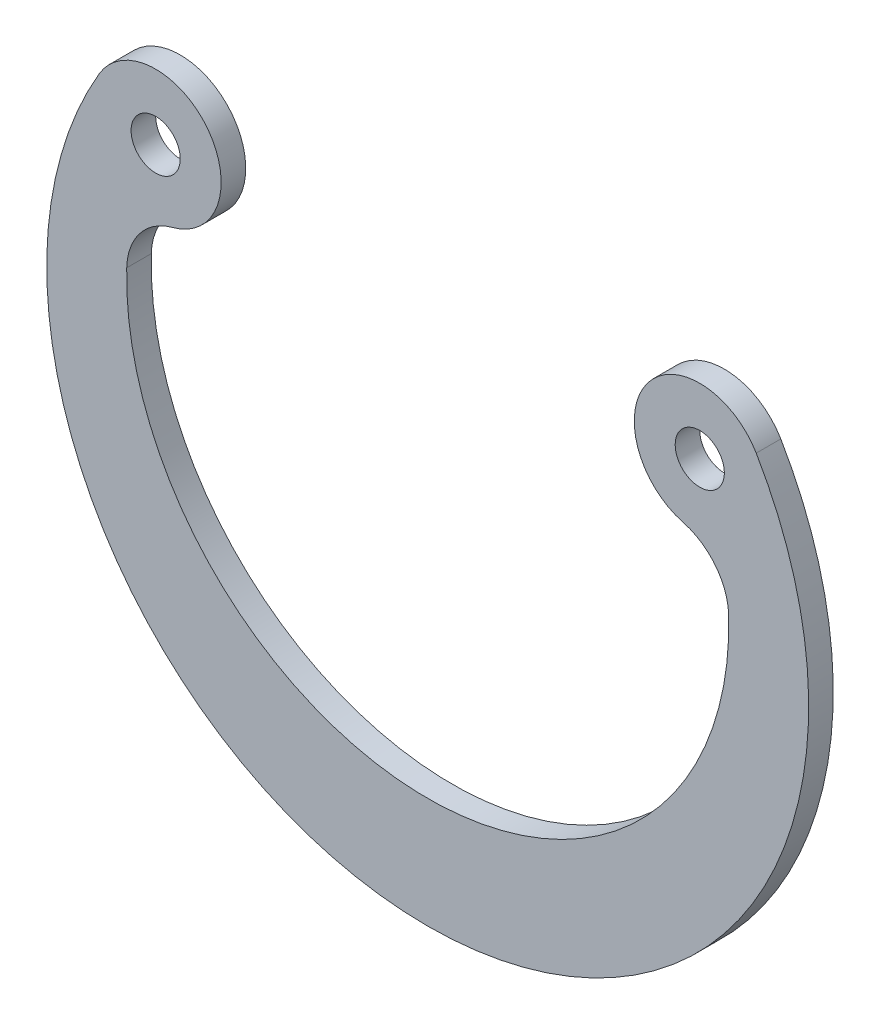
ISO-10303-21;
HEADER;
FILE_DESCRIPTION(('STEP AP214'),'2;1');
FILE_NAME('part.step','',(''),(''),'','','');
FILE_SCHEMA(('AUTOMOTIVE_DESIGN { 1 0 10303 214 1 1 1 1 }'));
ENDSEC;
DATA;
#1=APPLICATION_CONTEXT('core data for automotive mechanical design processes');
#2=APPLICATION_PROTOCOL_DEFINITION('international standard','automotive_design',2000,#1);
#3=PRODUCT_CONTEXT('',#1,'mechanical');
#4=PRODUCT('Part','Part','',(#3));
#5=PRODUCT_RELATED_PRODUCT_CATEGORY('part','',(#4));
#6=PRODUCT_DEFINITION_FORMATION('','',#4);
#7=PRODUCT_DEFINITION_CONTEXT('part definition',#1,'design');
#8=PRODUCT_DEFINITION('design','',#6,#7);
#9=PRODUCT_DEFINITION_SHAPE('','',#8);
#10=(LENGTH_UNIT() NAMED_UNIT(*) SI_UNIT(.MILLI.,.METRE.));
#11=(NAMED_UNIT(*) PLANE_ANGLE_UNIT() SI_UNIT($,.RADIAN.));
#12=(NAMED_UNIT(*) SI_UNIT($,.STERADIAN.) SOLID_ANGLE_UNIT());
#13=UNCERTAINTY_MEASURE_WITH_UNIT(LENGTH_MEASURE(1.E-05),#10,'distance_accuracy_value','');
#14=(GEOMETRIC_REPRESENTATION_CONTEXT(3) GLOBAL_UNCERTAINTY_ASSIGNED_CONTEXT((#13)) GLOBAL_UNIT_ASSIGNED_CONTEXT((#10,
#11,#12)) REPRESENTATION_CONTEXT('',''));
#15=CARTESIAN_POINT('',(0.,0.,0.));
#16=DIRECTION('',(0.,0.,1.));
#17=DIRECTION('',(1.,0.,0.));
#18=AXIS2_PLACEMENT_3D('',#15,#16,#17);
#19=CARTESIAN_POINT('',(-11.0679718105893,6.5,-1.));
#20=DIRECTION('',(0.,0.,1.));
#21=DIRECTION('',(1.,0.,0.));
#22=AXIS2_PLACEMENT_3D('',#19,#20,#21);
#23=CYLINDRICAL_SURFACE('',#22,2.66450234700656);
#24=CARTESIAN_POINT('',(-11.0679718105893,6.5,0.));
#25=DIRECTION('',(0.,0.,1.));
#26=DIRECTION('',(1.,0.,0.));
#27=AXIS2_PLACEMENT_3D('',#24,#25,#26);
#28=CIRCLE('',#27,2.66450234700656);
#29=CARTESIAN_POINT('',(-10.3862423091899,3.92418602299678,0.));
#30=VERTEX_POINT('',#29);
#31=CARTESIAN_POINT('',(-13.3655560307882,7.84932557535107,0.));
#32=VERTEX_POINT('',#31);
#33=EDGE_CURVE('E122',#30,#32,#28,.T.);
#34=ORIENTED_EDGE('',*,*,#33,.F.);
#35=DIRECTION('',(0.,0.,1.));
#36=VECTOR('',#35,1.);
#37=CARTESIAN_POINT('',(-10.3862423091899,3.92418602299678,-1.));
#38=LINE('',#37,#36);
#39=CARTESIAN_POINT('',(-10.3862423091899,3.92418602299678,-1.));
#40=VERTEX_POINT('',#39);
#41=EDGE_CURVE('E11',#40,#30,#38,.T.);
#42=ORIENTED_EDGE('',*,*,#41,.F.);
#43=CARTESIAN_POINT('',(-11.0679718105893,6.5,-1.));
#44=DIRECTION('',(0.,0.,1.));
#45=DIRECTION('',(1.,0.,0.));
#46=AXIS2_PLACEMENT_3D('',#43,#44,#45);
#47=CIRCLE('',#46,2.66450234700656);
#48=CARTESIAN_POINT('',(-13.3655560307882,7.84932557535107,-1.));
#49=VERTEX_POINT('',#48);
#50=EDGE_CURVE('E137',#40,#49,#47,.T.);
#51=ORIENTED_EDGE('',*,*,#50,.T.);
#52=DIRECTION('',(0.,0.,1.));
#53=VECTOR('',#52,1.);
#54=CARTESIAN_POINT('',(-13.3655560307882,7.84932557535107,-1.));
#55=LINE('',#54,#53);
#56=EDGE_CURVE('E40',#49,#32,#55,.T.);
#57=ORIENTED_EDGE('',*,*,#56,.T.);
#58=EDGE_LOOP('',(#34,#42,#51,#57));
#59=FACE_BOUND('',#58,.T.);
#60=ADVANCED_FACE('F37',(#59),#23,.T.);
#61=CARTESIAN_POINT('',(-9.74660175664426,1.50739890710529,-1.));
#62=DIRECTION('',(0.,0.,1.));
#63=DIRECTION('',(1.,0.,0.));
#64=AXIS2_PLACEMENT_3D('',#61,#62,#63);
#65=CYLINDRICAL_SURFACE('',#64,2.5);
#66=CARTESIAN_POINT('',(-9.74660175664426,1.50739890710529,0.));
#67=DIRECTION('',(0.,0.,-1.));
#68=DIRECTION('',(-1.,0.,0.));
#69=AXIS2_PLACEMENT_3D('',#66,#67,#68);
#70=CIRCLE('',#69,2.5);
#71=CARTESIAN_POINT('',(-12.2457304121941,1.57339862687588,0.));
#72=VERTEX_POINT('',#71);
#73=EDGE_CURVE('E135',#72,#30,#70,.T.);
#74=ORIENTED_EDGE('',*,*,#73,.F.);
#75=DIRECTION('',(0.,0.,1.));
#76=VECTOR('',#75,1.);
#77=CARTESIAN_POINT('',(-12.2457304121941,1.57339862687588,-1.));
#78=LINE('',#77,#76);
#79=CARTESIAN_POINT('',(-12.2457304121941,1.57339862687588,-1.));
#80=VERTEX_POINT('',#79);
#81=EDGE_CURVE('E46',#80,#72,#78,.T.);
#82=ORIENTED_EDGE('',*,*,#81,.F.);
#83=CARTESIAN_POINT('',(-9.74660175664426,1.50739890710529,-1.));
#84=DIRECTION('',(0.,0.,-1.));
#85=DIRECTION('',(-1.,0.,0.));
#86=AXIS2_PLACEMENT_3D('',#83,#84,#85);
#87=CIRCLE('',#86,2.5);
#88=EDGE_CURVE('E112',#80,#40,#87,.T.);
#89=ORIENTED_EDGE('',*,*,#88,.T.);
#90=ORIENTED_EDGE('',*,*,#41,.T.);
#91=EDGE_LOOP('',(#74,#82,#89,#90));
#92=FACE_BOUND('',#91,.T.);
#93=ADVANCED_FACE('F145',(#92),#65,.F.);
#94=CARTESIAN_POINT('',(0.,1.25,-1.));
#95=DIRECTION('',(0.,0.,1.));
#96=DIRECTION('',(1.,0.,0.));
#97=AXIS2_PLACEMENT_3D('',#94,#95,#96);
#98=CYLINDRICAL_SURFACE('',#97,12.25);
#99=CARTESIAN_POINT('',(0.,1.25,0.));
#100=DIRECTION('',(0.,0.,-1.));
#101=DIRECTION('',(-1.,0.,0.));
#102=AXIS2_PLACEMENT_3D('',#99,#100,#101);
#103=CIRCLE('',#102,12.25);
#104=CARTESIAN_POINT('',(12.2457304121941,1.57339862687588,0.));
#105=VERTEX_POINT('',#104);
#106=EDGE_CURVE('E99',#105,#72,#103,.T.);
#107=ORIENTED_EDGE('',*,*,#106,.F.);
#108=DIRECTION('',(0.,0.,1.));
#109=VECTOR('',#108,1.);
#110=CARTESIAN_POINT('',(12.2457304121941,1.57339862687588,-1.));
#111=LINE('',#110,#109);
#112=CARTESIAN_POINT('',(12.2457304121941,1.57339862687588,-1.));
#113=VERTEX_POINT('',#112);
#114=EDGE_CURVE('E94',#113,#105,#111,.T.);
#115=ORIENTED_EDGE('',*,*,#114,.F.);
#116=CARTESIAN_POINT('',(0.,1.25,-1.));
#117=DIRECTION('',(0.,0.,-1.));
#118=DIRECTION('',(-1.,0.,0.));
#119=AXIS2_PLACEMENT_3D('',#116,#117,#118);
#120=CIRCLE('',#119,12.25);
#121=EDGE_CURVE('E97',#113,#80,#120,.T.);
#122=ORIENTED_EDGE('',*,*,#121,.T.);
#123=ORIENTED_EDGE('',*,*,#81,.T.);
#124=EDGE_LOOP('',(#107,#115,#122,#123));
#125=FACE_BOUND('',#124,.T.);
#126=ADVANCED_FACE('F96',(#125),#98,.F.);
#127=CARTESIAN_POINT('',(9.74660175664426,1.50739890710529,-1.));
#128=DIRECTION('',(0.,0.,1.));
#129=DIRECTION('',(1.,0.,0.));
#130=AXIS2_PLACEMENT_3D('',#127,#128,#129);
#131=CYLINDRICAL_SURFACE('',#130,2.5);
#132=CARTESIAN_POINT('',(9.74660175664426,1.50739890710529,0.));
#133=DIRECTION('',(0.,0.,-1.));
#134=DIRECTION('',(-1.,0.,0.));
#135=AXIS2_PLACEMENT_3D('',#132,#133,#134);
#136=CIRCLE('',#135,2.5);
#137=CARTESIAN_POINT('',(10.3862423091899,3.92418602299678,0.));
#138=VERTEX_POINT('',#137);
#139=EDGE_CURVE('E132',#138,#105,#136,.T.);
#140=ORIENTED_EDGE('',*,*,#139,.F.);
#141=DIRECTION('',(0.,0.,1.));
#142=VECTOR('',#141,1.);
#143=CARTESIAN_POINT('',(10.3862423091899,3.92418602299678,-1.));
#144=LINE('',#143,#142);
#145=CARTESIAN_POINT('',(10.3862423091899,3.92418602299678,-1.));
#146=VERTEX_POINT('',#145);
#147=EDGE_CURVE('E104',#146,#138,#144,.T.);
#148=ORIENTED_EDGE('',*,*,#147,.F.);
#149=CARTESIAN_POINT('',(9.74660175664426,1.50739890710529,-1.));
#150=DIRECTION('',(0.,0.,-1.));
#151=DIRECTION('',(-1.,0.,0.));
#152=AXIS2_PLACEMENT_3D('',#149,#150,#151);
#153=CIRCLE('',#152,2.5);
#154=EDGE_CURVE('E110',#146,#113,#153,.T.);
#155=ORIENTED_EDGE('',*,*,#154,.T.);
#156=ORIENTED_EDGE('',*,*,#114,.T.);
#157=EDGE_LOOP('',(#140,#148,#155,#156));
#158=FACE_BOUND('',#157,.T.);
#159=ADVANCED_FACE('F114',(#158),#131,.F.);
#160=CARTESIAN_POINT('',(11.0679718105893,6.5,-1.));
#161=DIRECTION('',(0.,0.,1.));
#162=DIRECTION('',(1.,0.,0.));
#163=AXIS2_PLACEMENT_3D('',#160,#161,#162);
#164=CYLINDRICAL_SURFACE('',#163,2.66450234700656);
#165=CARTESIAN_POINT('',(11.0679718105893,6.5,0.));
#166=DIRECTION('',(0.,0.,1.));
#167=DIRECTION('',(1.,0.,0.));
#168=AXIS2_PLACEMENT_3D('',#165,#166,#167);
#169=CIRCLE('',#168,2.66450234700656);
#170=CARTESIAN_POINT('',(13.3655560307882,7.84932557535107,0.));
#171=VERTEX_POINT('',#170);
#172=EDGE_CURVE('E129',#171,#138,#169,.T.);
#173=ORIENTED_EDGE('',*,*,#172,.F.);
#174=DIRECTION('',(0.,0.,1.));
#175=VECTOR('',#174,1.);
#176=CARTESIAN_POINT('',(13.3655560307882,7.84932557535107,-1.));
#177=LINE('',#176,#175);
#178=CARTESIAN_POINT('',(13.3655560307882,7.84932557535107,-1.));
#179=VERTEX_POINT('',#178);
#180=EDGE_CURVE('E140',#179,#171,#177,.T.);
#181=ORIENTED_EDGE('',*,*,#180,.F.);
#182=CARTESIAN_POINT('',(11.0679718105893,6.5,-1.));
#183=DIRECTION('',(0.,0.,1.));
#184=DIRECTION('',(1.,0.,0.));
#185=AXIS2_PLACEMENT_3D('',#182,#183,#184);
#186=CIRCLE('',#185,2.66450234700656);
#187=EDGE_CURVE('E115',#179,#146,#186,.T.);
#188=ORIENTED_EDGE('',*,*,#187,.T.);
#189=ORIENTED_EDGE('',*,*,#147,.T.);
#190=EDGE_LOOP('',(#173,#181,#188,#189));
#191=FACE_BOUND('',#190,.T.);
#192=ADVANCED_FACE('F158',(#191),#164,.T.);
#193=CARTESIAN_POINT('',(0.,0.,-1.));
#194=DIRECTION('',(0.,0.,1.));
#195=DIRECTION('',(1.,0.,0.));
#196=AXIS2_PLACEMENT_3D('',#193,#194,#195);
#197=CYLINDRICAL_SURFACE('',#196,15.5);
#198=CARTESIAN_POINT('',(0.,0.,0.));
#199=DIRECTION('',(0.,0.,1.));
#200=DIRECTION('',(1.,0.,0.));
#201=AXIS2_PLACEMENT_3D('',#198,#199,#200);
#202=CIRCLE('',#201,15.5);
#203=EDGE_CURVE('E125',#32,#171,#202,.T.);
#204=ORIENTED_EDGE('',*,*,#203,.F.);
#205=ORIENTED_EDGE('',*,*,#56,.F.);
#206=CARTESIAN_POINT('',(0.,0.,-1.));
#207=DIRECTION('',(0.,0.,1.));
#208=DIRECTION('',(1.,0.,0.));
#209=AXIS2_PLACEMENT_3D('',#206,#207,#208);
#210=CIRCLE('',#209,15.5);
#211=EDGE_CURVE('E117',#49,#179,#210,.T.);
#212=ORIENTED_EDGE('',*,*,#211,.T.);
#213=ORIENTED_EDGE('',*,*,#180,.T.);
#214=EDGE_LOOP('',(#204,#205,#212,#213));
#215=FACE_BOUND('',#214,.T.);
#216=ADVANCED_FACE('F142',(#215),#197,.T.);
#217=CARTESIAN_POINT('',(-5.53398590529466,3.25,-1.));
#218=DIRECTION('',(0.,0.,1.));
#219=DIRECTION('',(1.,0.,0.));
#220=AXIS2_PLACEMENT_3D('',#217,#218,#219);
#221=PLANE('',#220);
#222=CARTESIAN_POINT('',(11.0679718105893,6.5,-1.));
#223=DIRECTION('',(0.,0.,1.));
#224=DIRECTION('',(-1.,0.,0.));
#225=AXIS2_PLACEMENT_3D('',#222,#223,#224);
#226=CIRCLE('',#225,1.);
#227=CARTESIAN_POINT('',(10.0679718105893,6.5,-1.));
#228=VERTEX_POINT('',#227);
#229=EDGE_CURVE('E184',#228,#228,#226,.T.);
#230=ORIENTED_EDGE('',*,*,#229,.T.);
#231=EDGE_LOOP('',(#230));
#232=FACE_BOUND('',#231,.T.);
#233=CARTESIAN_POINT('',(-11.0679718105893,6.5,-1.));
#234=DIRECTION('',(0.,0.,1.));
#235=DIRECTION('',(-1.,0.,0.));
#236=AXIS2_PLACEMENT_3D('',#233,#234,#235);
#237=CIRCLE('',#236,1.);
#238=CARTESIAN_POINT('',(-12.0679718105893,6.5,-1.));
#239=VERTEX_POINT('',#238);
#240=EDGE_CURVE('E126',#239,#239,#237,.T.);
#241=ORIENTED_EDGE('',*,*,#240,.T.);
#242=EDGE_LOOP('',(#241));
#243=FACE_BOUND('',#242,.T.);
#244=ORIENTED_EDGE('',*,*,#50,.F.);
#245=ORIENTED_EDGE('',*,*,#88,.F.);
#246=ORIENTED_EDGE('',*,*,#121,.F.);
#247=ORIENTED_EDGE('',*,*,#154,.F.);
#248=ORIENTED_EDGE('',*,*,#187,.F.);
#249=ORIENTED_EDGE('',*,*,#211,.F.);
#250=EDGE_LOOP('',(#244,#245,#246,#247,#248,#249));
#251=FACE_BOUND('',#250,.T.);
#252=ADVANCED_FACE('F108',(#232,#243,#251),#221,.F.);
#253=CARTESIAN_POINT('',(-5.53398590529466,3.25,0.));
#254=DIRECTION('',(0.,0.,1.));
#255=DIRECTION('',(1.,0.,0.));
#256=AXIS2_PLACEMENT_3D('',#253,#254,#255);
#257=PLANE('',#256);
#258=CARTESIAN_POINT('',(11.0679718105893,6.5,0.));
#259=DIRECTION('',(0.,0.,1.));
#260=DIRECTION('',(-1.,0.,0.));
#261=AXIS2_PLACEMENT_3D('',#258,#259,#260);
#262=CIRCLE('',#261,1.);
#263=CARTESIAN_POINT('',(10.0679718105893,6.5,0.));
#264=VERTEX_POINT('',#263);
#265=EDGE_CURVE('E187',#264,#264,#262,.T.);
#266=ORIENTED_EDGE('',*,*,#265,.F.);
#267=EDGE_LOOP('',(#266));
#268=FACE_BOUND('',#267,.T.);
#269=CARTESIAN_POINT('',(-11.0679718105893,6.5,0.));
#270=DIRECTION('',(0.,0.,1.));
#271=DIRECTION('',(-1.,0.,0.));
#272=AXIS2_PLACEMENT_3D('',#269,#270,#271);
#273=CIRCLE('',#272,1.);
#274=CARTESIAN_POINT('',(-12.0679718105893,6.5,0.));
#275=VERTEX_POINT('',#274);
#276=EDGE_CURVE('E189',#275,#275,#273,.T.);
#277=ORIENTED_EDGE('',*,*,#276,.F.);
#278=EDGE_LOOP('',(#277));
#279=FACE_BOUND('',#278,.T.);
#280=ORIENTED_EDGE('',*,*,#33,.T.);
#281=ORIENTED_EDGE('',*,*,#203,.T.);
#282=ORIENTED_EDGE('',*,*,#172,.T.);
#283=ORIENTED_EDGE('',*,*,#139,.T.);
#284=ORIENTED_EDGE('',*,*,#106,.T.);
#285=ORIENTED_EDGE('',*,*,#73,.T.);
#286=EDGE_LOOP('',(#280,#281,#282,#283,#284,#285));
#287=FACE_BOUND('',#286,.T.);
#288=ADVANCED_FACE('F144',(#268,#279,#287),#257,.T.);
#289=CARTESIAN_POINT('',(-11.0679718105893,6.5,-1.));
#290=DIRECTION('',(0.,0.,1.));
#291=DIRECTION('',(1.,0.,0.));
#292=AXIS2_PLACEMENT_3D('',#289,#290,#291);
#293=CYLINDRICAL_SURFACE('',#292,1.);
#294=ORIENTED_EDGE('',*,*,#240,.F.);
#295=EDGE_LOOP('',(#294));
#296=FACE_BOUND('',#295,.T.);
#297=ORIENTED_EDGE('',*,*,#276,.T.);
#298=EDGE_LOOP('',(#297));
#299=FACE_BOUND('',#298,.T.);
#300=ADVANCED_FACE('F169',(#296,#299),#293,.F.);
#301=CARTESIAN_POINT('',(11.0679718105893,6.5,-1.));
#302=DIRECTION('',(0.,0.,1.));
#303=DIRECTION('',(1.,0.,0.));
#304=AXIS2_PLACEMENT_3D('',#301,#302,#303);
#305=CYLINDRICAL_SURFACE('',#304,1.);
#306=ORIENTED_EDGE('',*,*,#229,.F.);
#307=EDGE_LOOP('',(#306));
#308=FACE_BOUND('',#307,.T.);
#309=ORIENTED_EDGE('',*,*,#265,.T.);
#310=EDGE_LOOP('',(#309));
#311=FACE_BOUND('',#310,.T.);
#312=ADVANCED_FACE('F176',(#308,#311),#305,.F.);
#313=CLOSED_SHELL('',(#60,#93,#126,#159,#192,#216,#252,#288,#300,#312));
#314=MANIFOLD_SOLID_BREP('B2',#313);
#315=ADVANCED_BREP_SHAPE_REPRESENTATION('',(#18,#314),#14);
#316=SHAPE_DEFINITION_REPRESENTATION(#9,#315);
ENDSEC;
END-ISO-10303-21;
